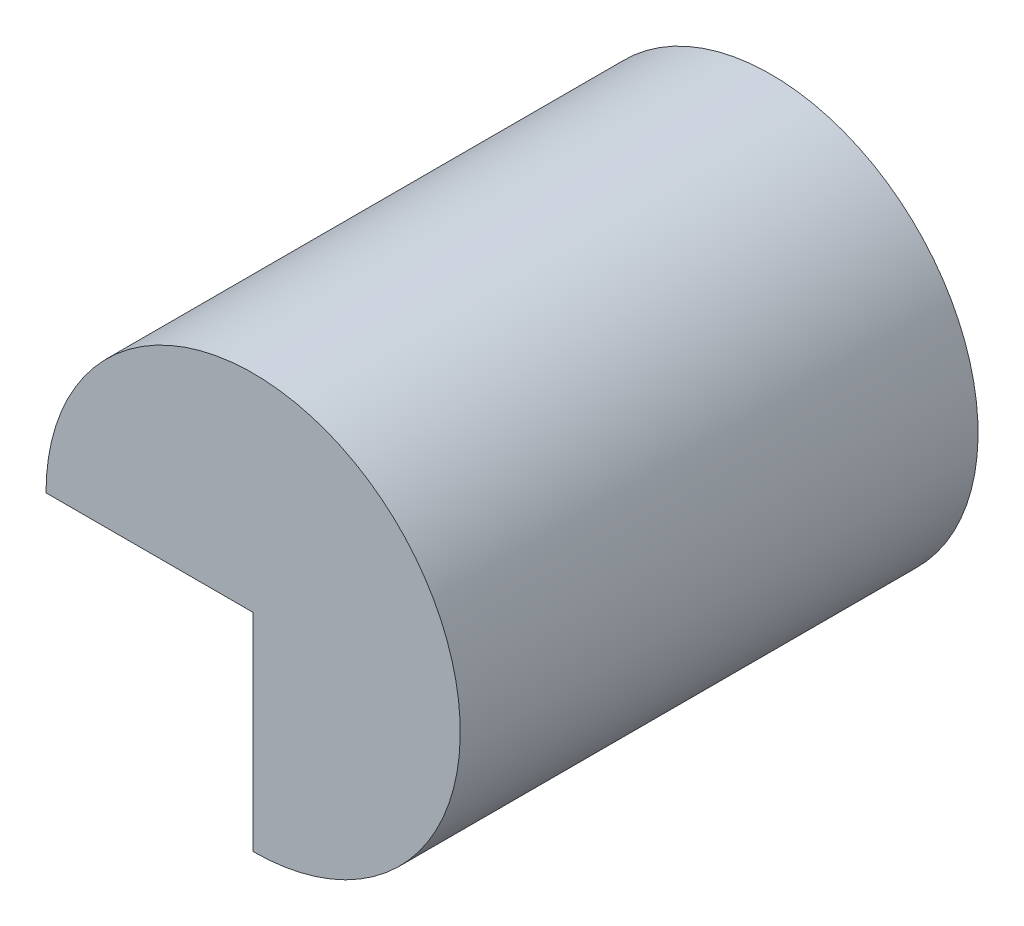
ISO-10303-21;
HEADER;
FILE_DESCRIPTION(('STEP AP214'),'2;1');
FILE_NAME('part.step','',(''),(''),'','','');
FILE_SCHEMA(('AUTOMOTIVE_DESIGN { 1 0 10303 214 1 1 1 1 }'));
ENDSEC;
DATA;
#1=APPLICATION_CONTEXT('core data for automotive mechanical design processes');
#2=APPLICATION_PROTOCOL_DEFINITION('international standard','automotive_design',2000,#1);
#3=PRODUCT_CONTEXT('',#1,'mechanical');
#4=PRODUCT('Part','Part','',(#3));
#5=PRODUCT_RELATED_PRODUCT_CATEGORY('part','',(#4));
#6=PRODUCT_DEFINITION_FORMATION('','',#4);
#7=PRODUCT_DEFINITION_CONTEXT('part definition',#1,'design');
#8=PRODUCT_DEFINITION('design','',#6,#7);
#9=PRODUCT_DEFINITION_SHAPE('','',#8);
#10=(LENGTH_UNIT() NAMED_UNIT(*) SI_UNIT(.MILLI.,.METRE.));
#11=(NAMED_UNIT(*) PLANE_ANGLE_UNIT() SI_UNIT($,.RADIAN.));
#12=(NAMED_UNIT(*) SI_UNIT($,.STERADIAN.) SOLID_ANGLE_UNIT());
#13=UNCERTAINTY_MEASURE_WITH_UNIT(LENGTH_MEASURE(1.E-05),#10,'distance_accuracy_value','');
#14=(GEOMETRIC_REPRESENTATION_CONTEXT(3) GLOBAL_UNCERTAINTY_ASSIGNED_CONTEXT((#13)) GLOBAL_UNIT_ASSIGNED_CONTEXT((#10,
#11,#12)) REPRESENTATION_CONTEXT('',''));
#15=CARTESIAN_POINT('',(0.,0.,0.));
#16=DIRECTION('',(0.,0.,1.));
#17=DIRECTION('',(1.,0.,0.));
#18=AXIS2_PLACEMENT_3D('',#15,#16,#17);
#19=CARTESIAN_POINT('',(0.,0.,25.));
#20=DIRECTION('',(1.,0.,0.));
#21=DIRECTION('',(0.,1.,0.));
#22=AXIS2_PLACEMENT_3D('',#19,#20,#21);
#23=PLANE('',#22);
#24=DIRECTION('',(0.,-1.,0.));
#25=VECTOR('',#24,1.);
#26=CARTESIAN_POINT('',(0.,0.,0.));
#27=LINE('',#26,#25);
#28=CARTESIAN_POINT('',(0.,0.,0.));
#29=VERTEX_POINT('',#28);
#30=CARTESIAN_POINT('',(0.,-9.99999999999998,0.));
#31=VERTEX_POINT('',#30);
#32=EDGE_CURVE('E80',#29,#31,#27,.T.);
#33=ORIENTED_EDGE('',*,*,#32,.T.);
#34=DIRECTION('',(0.,0.,-1.));
#35=VECTOR('',#34,1.);
#36=CARTESIAN_POINT('',(0.,-9.99999999999998,25.));
#37=LINE('',#36,#35);
#38=CARTESIAN_POINT('',(0.,-9.99999999999998,25.));
#39=VERTEX_POINT('',#38);
#40=EDGE_CURVE('E11',#39,#31,#37,.T.);
#41=ORIENTED_EDGE('',*,*,#40,.F.);
#42=DIRECTION('',(0.,-1.,0.));
#43=VECTOR('',#42,1.);
#44=CARTESIAN_POINT('',(0.,0.,25.));
#45=LINE('',#44,#43);
#46=CARTESIAN_POINT('',(0.,0.,25.));
#47=VERTEX_POINT('',#46);
#48=EDGE_CURVE('E73',#47,#39,#45,.T.);
#49=ORIENTED_EDGE('',*,*,#48,.F.);
#50=DIRECTION('',(0.,0.,-1.));
#51=VECTOR('',#50,1.);
#52=CARTESIAN_POINT('',(0.,0.,25.));
#53=LINE('',#52,#51);
#54=EDGE_CURVE('E81',#47,#29,#53,.T.);
#55=ORIENTED_EDGE('',*,*,#54,.T.);
#56=EDGE_LOOP('',(#33,#41,#49,#55));
#57=FACE_BOUND('',#56,.T.);
#58=ADVANCED_FACE('F33',(#57),#23,.F.);
#59=CARTESIAN_POINT('',(0.,0.,25.));
#60=DIRECTION('',(0.,0.,-1.));
#61=DIRECTION('',(-1.,0.,0.));
#62=AXIS2_PLACEMENT_3D('',#59,#60,#61);
#63=CYLINDRICAL_SURFACE('',#62,9.99999999999998);
#64=CARTESIAN_POINT('',(0.,0.,0.));
#65=DIRECTION('',(0.,0.,1.));
#66=DIRECTION('',(1.,0.,0.));
#67=AXIS2_PLACEMENT_3D('',#64,#65,#66);
#68=CIRCLE('',#67,9.99999999999998);
#69=CARTESIAN_POINT('',(-9.99999999999998,0.,0.));
#70=VERTEX_POINT('',#69);
#71=EDGE_CURVE('E61',#31,#70,#68,.T.);
#72=ORIENTED_EDGE('',*,*,#71,.T.);
#73=DIRECTION('',(0.,0.,-1.));
#74=VECTOR('',#73,1.);
#75=CARTESIAN_POINT('',(-9.99999999999998,0.,25.));
#76=LINE('',#75,#74);
#77=CARTESIAN_POINT('',(-9.99999999999998,0.,25.));
#78=VERTEX_POINT('',#77);
#79=EDGE_CURVE('E41',#78,#70,#76,.T.);
#80=ORIENTED_EDGE('',*,*,#79,.F.);
#81=CARTESIAN_POINT('',(0.,0.,25.));
#82=DIRECTION('',(0.,0.,1.));
#83=DIRECTION('',(1.,0.,0.));
#84=AXIS2_PLACEMENT_3D('',#81,#82,#83);
#85=CIRCLE('',#84,9.99999999999998);
#86=EDGE_CURVE('E69',#39,#78,#85,.T.);
#87=ORIENTED_EDGE('',*,*,#86,.F.);
#88=ORIENTED_EDGE('',*,*,#40,.T.);
#89=EDGE_LOOP('',(#72,#80,#87,#88));
#90=FACE_BOUND('',#89,.T.);
#91=ADVANCED_FACE('F70',(#90),#63,.T.);
#92=CARTESIAN_POINT('',(-9.99999999999998,0.,25.));
#93=DIRECTION('',(0.,1.,0.));
#94=DIRECTION('',(0.,0.,1.));
#95=AXIS2_PLACEMENT_3D('',#92,#93,#94);
#96=PLANE('',#95);
#97=DIRECTION('',(1.,0.,0.));
#98=VECTOR('',#97,1.);
#99=CARTESIAN_POINT('',(-9.99999999999998,0.,0.));
#100=LINE('',#99,#98);
#101=EDGE_CURVE('E66',#70,#29,#100,.T.);
#102=ORIENTED_EDGE('',*,*,#101,.T.);
#103=ORIENTED_EDGE('',*,*,#54,.F.);
#104=DIRECTION('',(1.,0.,0.));
#105=VECTOR('',#104,1.);
#106=CARTESIAN_POINT('',(-9.99999999999998,0.,25.));
#107=LINE('',#106,#105);
#108=EDGE_CURVE('E49',#78,#47,#107,.T.);
#109=ORIENTED_EDGE('',*,*,#108,.F.);
#110=ORIENTED_EDGE('',*,*,#79,.T.);
#111=EDGE_LOOP('',(#102,#103,#109,#110));
#112=FACE_BOUND('',#111,.T.);
#113=ADVANCED_FACE('F88',(#112),#96,.F.);
#114=CARTESIAN_POINT('',(0.,0.,25.));
#115=DIRECTION('',(0.,0.,1.));
#116=DIRECTION('',(1.,0.,0.));
#117=AXIS2_PLACEMENT_3D('',#114,#115,#116);
#118=PLANE('',#117);
#119=ORIENTED_EDGE('',*,*,#48,.T.);
#120=ORIENTED_EDGE('',*,*,#86,.T.);
#121=ORIENTED_EDGE('',*,*,#108,.T.);
#122=EDGE_LOOP('',(#119,#120,#121));
#123=FACE_BOUND('',#122,.T.);
#124=ADVANCED_FACE('F76',(#123),#118,.T.);
#125=CARTESIAN_POINT('',(0.,0.,0.));
#126=DIRECTION('',(0.,0.,1.));
#127=DIRECTION('',(1.,0.,0.));
#128=AXIS2_PLACEMENT_3D('',#125,#126,#127);
#129=PLANE('',#128);
#130=ORIENTED_EDGE('',*,*,#32,.F.);
#131=ORIENTED_EDGE('',*,*,#101,.F.);
#132=ORIENTED_EDGE('',*,*,#71,.F.);
#133=EDGE_LOOP('',(#130,#131,#132));
#134=FACE_BOUND('',#133,.T.);
#135=ADVANCED_FACE('F89',(#134),#129,.F.);
#136=CLOSED_SHELL('',(#58,#91,#113,#124,#135));
#137=MANIFOLD_SOLID_BREP('B2',#136);
#138=ADVANCED_BREP_SHAPE_REPRESENTATION('',(#18,#137),#14);
#139=SHAPE_DEFINITION_REPRESENTATION(#9,#138);
ENDSEC;
END-ISO-10303-21;
